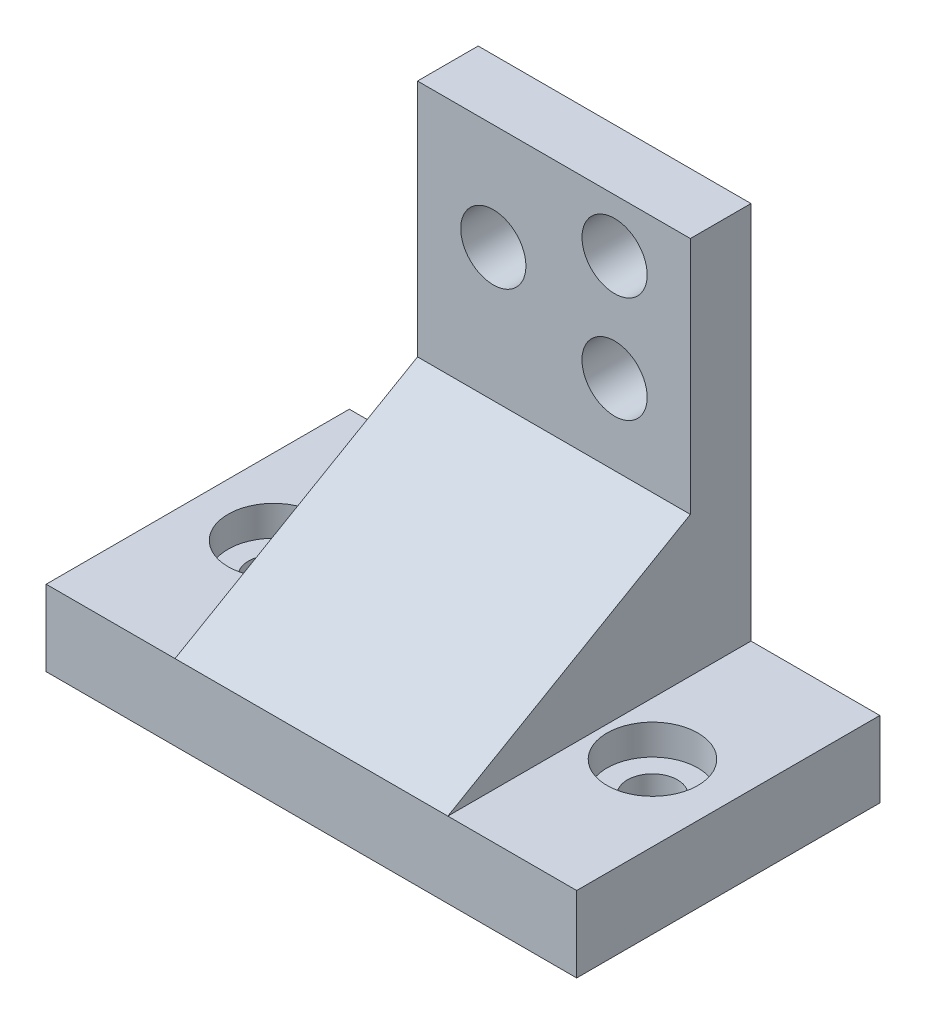
ISO-10303-21;
HEADER;
FILE_DESCRIPTION(('STEP AP214'),'2;1');
FILE_NAME('part.step','',(''),(''),'','','');
FILE_SCHEMA(('AUTOMOTIVE_DESIGN { 1 0 10303 214 1 1 1 1 }'));
ENDSEC;
DATA;
#1=APPLICATION_CONTEXT('core data for automotive mechanical design processes');
#2=APPLICATION_PROTOCOL_DEFINITION('international standard','automotive_design',2000,#1);
#3=PRODUCT_CONTEXT('',#1,'mechanical');
#4=PRODUCT('Part','Part','',(#3));
#5=PRODUCT_RELATED_PRODUCT_CATEGORY('part','',(#4));
#6=PRODUCT_DEFINITION_FORMATION('','',#4);
#7=PRODUCT_DEFINITION_CONTEXT('part definition',#1,'design');
#8=PRODUCT_DEFINITION('design','',#6,#7);
#9=PRODUCT_DEFINITION_SHAPE('','',#8);
#10=(LENGTH_UNIT() NAMED_UNIT(*) SI_UNIT(.MILLI.,.METRE.));
#11=(NAMED_UNIT(*) PLANE_ANGLE_UNIT() SI_UNIT($,.RADIAN.));
#12=(NAMED_UNIT(*) SI_UNIT($,.STERADIAN.) SOLID_ANGLE_UNIT());
#13=UNCERTAINTY_MEASURE_WITH_UNIT(LENGTH_MEASURE(1.E-05),#10,'distance_accuracy_value','');
#14=(GEOMETRIC_REPRESENTATION_CONTEXT(3) GLOBAL_UNCERTAINTY_ASSIGNED_CONTEXT((#13)) GLOBAL_UNIT_ASSIGNED_CONTEXT((#10,
#11,#12)) REPRESENTATION_CONTEXT('',''));
#15=CARTESIAN_POINT('',(0.,0.,0.));
#16=DIRECTION('',(0.,0.,1.));
#17=DIRECTION('',(1.,0.,0.));
#18=AXIS2_PLACEMENT_3D('',#15,#16,#17);
#19=CARTESIAN_POINT('',(0.,5.,0.));
#20=DIRECTION('',(0.,-1.,0.));
#21=DIRECTION('',(0.,0.,-1.));
#22=AXIS2_PLACEMENT_3D('',#19,#20,#21);
#23=PLANE('',#22);
#24=CARTESIAN_POINT('',(12.5,5.,0.));
#25=DIRECTION('',(0.,1.,0.));
#26=DIRECTION('',(0.,0.,-1.));
#27=AXIS2_PLACEMENT_3D('',#24,#25,#26);
#28=CIRCLE('',#27,3.);
#29=CARTESIAN_POINT('',(12.5,5.,-3.));
#30=VERTEX_POINT('',#29);
#31=EDGE_CURVE('E221',#30,#30,#28,.T.);
#32=ORIENTED_EDGE('',*,*,#31,.F.);
#33=EDGE_LOOP('',(#32));
#34=FACE_BOUND('',#33,.T.);
#35=DIRECTION('',(0.,0.,-1.));
#36=VECTOR('',#35,1.);
#37=CARTESIAN_POINT('',(9.,5.,-6.));
#38=LINE('',#37,#36);
#39=CARTESIAN_POINT('',(9.,5.,10.));
#40=VERTEX_POINT('',#39);
#41=CARTESIAN_POINT('',(9.,5.,-10.));
#42=VERTEX_POINT('',#41);
#43=EDGE_CURVE('E51',#40,#42,#38,.T.);
#44=ORIENTED_EDGE('',*,*,#43,.F.);
#45=DIRECTION('',(1.,0.,0.));
#46=VECTOR('',#45,1.);
#47=CARTESIAN_POINT('',(-17.5,5.,10.));
#48=LINE('',#47,#46);
#49=CARTESIAN_POINT('',(17.5,5.,10.));
#50=VERTEX_POINT('',#49);
#51=EDGE_CURVE('E148',#40,#50,#48,.T.);
#52=ORIENTED_EDGE('',*,*,#51,.T.);
#53=DIRECTION('',(0.,0.,-1.));
#54=VECTOR('',#53,1.);
#55=CARTESIAN_POINT('',(17.5,5.,10.));
#56=LINE('',#55,#54);
#57=CARTESIAN_POINT('',(17.5,5.,-10.));
#58=VERTEX_POINT('',#57);
#59=EDGE_CURVE('E139',#50,#58,#56,.T.);
#60=ORIENTED_EDGE('',*,*,#59,.T.);
#61=DIRECTION('',(-1.,0.,0.));
#62=VECTOR('',#61,1.);
#63=CARTESIAN_POINT('',(-17.5,5.,-10.));
#64=LINE('',#63,#62);
#65=EDGE_CURVE('E144',#58,#42,#64,.T.);
#66=ORIENTED_EDGE('',*,*,#65,.T.);
#67=EDGE_LOOP('',(#44,#52,#60,#66));
#68=FACE_BOUND('',#67,.T.);
#69=ADVANCED_FACE('F35',(#34,#68),#23,.F.);
#70=CARTESIAN_POINT('',(-12.5,5.,0.));
#71=DIRECTION('',(0.,-1.,0.));
#72=DIRECTION('',(0.,0.,-1.));
#73=AXIS2_PLACEMENT_3D('',#70,#71,#72);
#74=CYLINDRICAL_SURFACE('',#73,1.65);
#75=CARTESIAN_POINT('',(-12.5,0.,0.));
#76=DIRECTION('',(0.,1.,0.));
#77=DIRECTION('',(0.,0.,1.));
#78=AXIS2_PLACEMENT_3D('',#75,#76,#77);
#79=CIRCLE('',#78,1.65);
#80=CARTESIAN_POINT('',(-12.5,0.,1.65));
#81=VERTEX_POINT('',#80);
#82=EDGE_CURVE('E130',#81,#81,#79,.T.);
#83=ORIENTED_EDGE('',*,*,#82,.F.);
#84=EDGE_LOOP('',(#83));
#85=FACE_BOUND('',#84,.T.);
#86=CARTESIAN_POINT('',(-12.5,3.,0.));
#87=DIRECTION('',(0.,1.,0.));
#88=DIRECTION('',(0.,0.,1.));
#89=AXIS2_PLACEMENT_3D('',#86,#87,#88);
#90=CIRCLE('',#89,1.65);
#91=CARTESIAN_POINT('',(-12.5,3.,1.65));
#92=VERTEX_POINT('',#91);
#93=EDGE_CURVE('E176',#92,#92,#90,.T.);
#94=ORIENTED_EDGE('',*,*,#93,.T.);
#95=EDGE_LOOP('',(#94));
#96=FACE_BOUND('',#95,.T.);
#97=ADVANCED_FACE('F246',(#85,#96),#74,.F.);
#98=CARTESIAN_POINT('',(-12.5,5.,0.));
#99=DIRECTION('',(0.,1.,0.));
#100=DIRECTION('',(0.,0.,1.));
#101=AXIS2_PLACEMENT_3D('',#98,#99,#100);
#102=CIRCLE('',#101,3.);
#103=CARTESIAN_POINT('',(-12.5,5.,3.));
#104=VERTEX_POINT('',#103);
#105=EDGE_CURVE('E227',#104,#104,#102,.T.);
#106=ORIENTED_EDGE('',*,*,#105,.F.);
#107=EDGE_LOOP('',(#106));
#108=FACE_BOUND('',#107,.T.);
#109=CARTESIAN_POINT('',(-17.5,5.,10.));
#110=VERTEX_POINT('',#109);
#111=CARTESIAN_POINT('',(-9.,5.,10.));
#112=VERTEX_POINT('',#111);
#113=EDGE_CURVE('E149',#110,#112,#48,.T.);
#114=ORIENTED_EDGE('',*,*,#113,.T.);
#115=DIRECTION('',(0.,0.,1.));
#116=VECTOR('',#115,1.);
#117=CARTESIAN_POINT('',(-9.,5.,-6.));
#118=LINE('',#117,#116);
#119=CARTESIAN_POINT('',(-9.,5.,-10.));
#120=VERTEX_POINT('',#119);
#121=EDGE_CURVE('E58',#120,#112,#118,.T.);
#122=ORIENTED_EDGE('',*,*,#121,.F.);
#123=CARTESIAN_POINT('',(-17.5,5.,-10.));
#124=VERTEX_POINT('',#123);
#125=EDGE_CURVE('E142',#120,#124,#64,.T.);
#126=ORIENTED_EDGE('',*,*,#125,.T.);
#127=DIRECTION('',(0.,0.,1.));
#128=VECTOR('',#127,1.);
#129=CARTESIAN_POINT('',(-17.5,5.,10.));
#130=LINE('',#129,#128);
#131=EDGE_CURVE('E146',#124,#110,#130,.T.);
#132=ORIENTED_EDGE('',*,*,#131,.T.);
#133=EDGE_LOOP('',(#114,#122,#126,#132));
#134=FACE_BOUND('',#133,.T.);
#135=ADVANCED_FACE('F242',(#108,#134),#23,.F.);
#136=CARTESIAN_POINT('',(0.,0.,0.));
#137=DIRECTION('',(0.,-1.,0.));
#138=DIRECTION('',(0.,0.,-1.));
#139=AXIS2_PLACEMENT_3D('',#136,#137,#138);
#140=PLANE('',#139);
#141=ORIENTED_EDGE('',*,*,#82,.T.);
#142=EDGE_LOOP('',(#141));
#143=FACE_BOUND('',#142,.T.);
#144=DIRECTION('',(0.,0.,-1.));
#145=VECTOR('',#144,1.);
#146=CARTESIAN_POINT('',(17.5,0.,10.));
#147=LINE('',#146,#145);
#148=CARTESIAN_POINT('',(17.5,0.,10.));
#149=VERTEX_POINT('',#148);
#150=CARTESIAN_POINT('',(17.5,0.,-10.));
#151=VERTEX_POINT('',#150);
#152=EDGE_CURVE('E138',#149,#151,#147,.T.);
#153=ORIENTED_EDGE('',*,*,#152,.F.);
#154=DIRECTION('',(1.,0.,0.));
#155=VECTOR('',#154,1.);
#156=CARTESIAN_POINT('',(-17.5,0.,10.));
#157=LINE('',#156,#155);
#158=CARTESIAN_POINT('',(-17.5,0.,10.));
#159=VERTEX_POINT('',#158);
#160=EDGE_CURVE('E143',#159,#149,#157,.T.);
#161=ORIENTED_EDGE('',*,*,#160,.F.);
#162=DIRECTION('',(0.,0.,1.));
#163=VECTOR('',#162,1.);
#164=CARTESIAN_POINT('',(-17.5,0.,10.));
#165=LINE('',#164,#163);
#166=CARTESIAN_POINT('',(-17.5,0.,-10.));
#167=VERTEX_POINT('',#166);
#168=EDGE_CURVE('E158',#167,#159,#165,.T.);
#169=ORIENTED_EDGE('',*,*,#168,.F.);
#170=DIRECTION('',(-1.,0.,0.));
#171=VECTOR('',#170,1.);
#172=CARTESIAN_POINT('',(-17.5,0.,-10.));
#173=LINE('',#172,#171);
#174=EDGE_CURVE('E156',#151,#167,#173,.T.);
#175=ORIENTED_EDGE('',*,*,#174,.F.);
#176=EDGE_LOOP('',(#153,#161,#169,#175));
#177=FACE_BOUND('',#176,.T.);
#178=CARTESIAN_POINT('',(12.5,0.,0.));
#179=DIRECTION('',(0.,1.,0.));
#180=DIRECTION('',(0.,0.,-1.));
#181=AXIS2_PLACEMENT_3D('',#178,#179,#180);
#182=CIRCLE('',#181,1.65);
#183=CARTESIAN_POINT('',(12.5,0.,-1.65));
#184=VERTEX_POINT('',#183);
#185=EDGE_CURVE('E127',#184,#184,#182,.T.);
#186=ORIENTED_EDGE('',*,*,#185,.T.);
#187=EDGE_LOOP('',(#186));
#188=FACE_BOUND('',#187,.T.);
#189=ADVANCED_FACE('F245',(#143,#177,#188),#140,.T.);
#190=CARTESIAN_POINT('',(17.5,5.,10.));
#191=DIRECTION('',(-1.,0.,0.));
#192=DIRECTION('',(0.,0.,1.));
#193=AXIS2_PLACEMENT_3D('',#190,#191,#192);
#194=PLANE('',#193);
#195=ORIENTED_EDGE('',*,*,#152,.T.);
#196=DIRECTION('',(0.,-1.,0.));
#197=VECTOR('',#196,1.);
#198=CARTESIAN_POINT('',(17.5,5.,-10.));
#199=LINE('',#198,#197);
#200=EDGE_CURVE('E169',#58,#151,#199,.T.);
#201=ORIENTED_EDGE('',*,*,#200,.F.);
#202=ORIENTED_EDGE('',*,*,#59,.F.);
#203=DIRECTION('',(0.,-1.,0.));
#204=VECTOR('',#203,1.);
#205=CARTESIAN_POINT('',(17.5,5.,10.));
#206=LINE('',#205,#204);
#207=EDGE_CURVE('E152',#50,#149,#206,.T.);
#208=ORIENTED_EDGE('',*,*,#207,.T.);
#209=EDGE_LOOP('',(#195,#201,#202,#208));
#210=FACE_BOUND('',#209,.T.);
#211=ADVANCED_FACE('F258',(#210),#194,.F.);
#212=CARTESIAN_POINT('',(-17.5,5.,-10.));
#213=DIRECTION('',(0.,0.,1.));
#214=DIRECTION('',(1.,0.,0.));
#215=AXIS2_PLACEMENT_3D('',#212,#213,#214);
#216=PLANE('',#215);
#217=CARTESIAN_POINT('',(-4.,23.,-10.));
#218=DIRECTION('',(0.,0.,1.));
#219=DIRECTION('',(1.,0.,0.));
#220=AXIS2_PLACEMENT_3D('',#217,#218,#219);
#221=CIRCLE('',#220,2.15);
#222=CARTESIAN_POINT('',(-1.85,23.,-10.));
#223=VERTEX_POINT('',#222);
#224=EDGE_CURVE('E202',#223,#223,#221,.F.);
#225=ORIENTED_EDGE('',*,*,#224,.F.);
#226=EDGE_LOOP('',(#225));
#227=FACE_BOUND('',#226,.T.);
#228=CARTESIAN_POINT('',(4.,26.5,-10.));
#229=DIRECTION('',(0.,0.,1.));
#230=DIRECTION('',(1.,0.,0.));
#231=AXIS2_PLACEMENT_3D('',#228,#229,#230);
#232=CIRCLE('',#231,2.15);
#233=CARTESIAN_POINT('',(6.15,26.5,-10.));
#234=VERTEX_POINT('',#233);
#235=EDGE_CURVE('E211',#234,#234,#232,.F.);
#236=ORIENTED_EDGE('',*,*,#235,.F.);
#237=EDGE_LOOP('',(#236));
#238=FACE_BOUND('',#237,.T.);
#239=CARTESIAN_POINT('',(4.,19.5,-10.));
#240=DIRECTION('',(0.,0.,1.));
#241=DIRECTION('',(1.,0.,0.));
#242=AXIS2_PLACEMENT_3D('',#239,#240,#241);
#243=CIRCLE('',#242,2.15);
#244=CARTESIAN_POINT('',(6.15,19.5,-10.));
#245=VERTEX_POINT('',#244);
#246=EDGE_CURVE('E205',#245,#245,#243,.F.);
#247=ORIENTED_EDGE('',*,*,#246,.F.);
#248=EDGE_LOOP('',(#247));
#249=FACE_BOUND('',#248,.T.);
#250=ORIENTED_EDGE('',*,*,#174,.T.);
#251=DIRECTION('',(0.,-1.,0.));
#252=VECTOR('',#251,1.);
#253=CARTESIAN_POINT('',(-17.5,5.,-10.));
#254=LINE('',#253,#252);
#255=EDGE_CURVE('E166',#124,#167,#254,.T.);
#256=ORIENTED_EDGE('',*,*,#255,.F.);
#257=ORIENTED_EDGE('',*,*,#125,.F.);
#258=DIRECTION('',(0.,-1.,0.));
#259=VECTOR('',#258,1.);
#260=CARTESIAN_POINT('',(-9.,30.,-10.));
#261=LINE('',#260,#259);
#262=CARTESIAN_POINT('',(-9.,30.,-10.));
#263=VERTEX_POINT('',#262);
#264=EDGE_CURVE('E112',#263,#120,#261,.T.);
#265=ORIENTED_EDGE('',*,*,#264,.F.);
#266=DIRECTION('',(-1.,0.,0.));
#267=VECTOR('',#266,1.);
#268=CARTESIAN_POINT('',(-9.,30.,-10.));
#269=LINE('',#268,#267);
#270=CARTESIAN_POINT('',(9.,30.,-10.));
#271=VERTEX_POINT('',#270);
#272=EDGE_CURVE('E106',#271,#263,#269,.T.);
#273=ORIENTED_EDGE('',*,*,#272,.F.);
#274=DIRECTION('',(0.,-1.,0.));
#275=VECTOR('',#274,1.);
#276=CARTESIAN_POINT('',(9.,30.,-10.));
#277=LINE('',#276,#275);
#278=EDGE_CURVE('E110',#271,#42,#277,.T.);
#279=ORIENTED_EDGE('',*,*,#278,.T.);
#280=ORIENTED_EDGE('',*,*,#65,.F.);
#281=ORIENTED_EDGE('',*,*,#200,.T.);
#282=EDGE_LOOP('',(#250,#256,#257,#265,#273,#279,#280,#281));
#283=FACE_BOUND('',#282,.T.);
#284=ADVANCED_FACE('F108',(#227,#238,#249,#283),#216,.F.);
#285=CARTESIAN_POINT('',(-17.5,5.,10.));
#286=DIRECTION('',(1.,0.,0.));
#287=DIRECTION('',(0.,0.,-1.));
#288=AXIS2_PLACEMENT_3D('',#285,#286,#287);
#289=PLANE('',#288);
#290=ORIENTED_EDGE('',*,*,#168,.T.);
#291=DIRECTION('',(0.,-1.,0.));
#292=VECTOR('',#291,1.);
#293=CARTESIAN_POINT('',(-17.5,5.,10.));
#294=LINE('',#293,#292);
#295=EDGE_CURVE('E163',#110,#159,#294,.T.);
#296=ORIENTED_EDGE('',*,*,#295,.F.);
#297=ORIENTED_EDGE('',*,*,#131,.F.);
#298=ORIENTED_EDGE('',*,*,#255,.T.);
#299=EDGE_LOOP('',(#290,#296,#297,#298));
#300=FACE_BOUND('',#299,.T.);
#301=ADVANCED_FACE('F260',(#300),#289,.F.);
#302=CARTESIAN_POINT('',(-17.5,5.,10.));
#303=DIRECTION('',(0.,0.,-1.));
#304=DIRECTION('',(-1.,0.,0.));
#305=AXIS2_PLACEMENT_3D('',#302,#303,#304);
#306=PLANE('',#305);
#307=ORIENTED_EDGE('',*,*,#160,.T.);
#308=ORIENTED_EDGE('',*,*,#207,.F.);
#309=ORIENTED_EDGE('',*,*,#51,.F.);
#310=EDGE_CURVE('E153',#112,#40,#48,.T.);
#311=ORIENTED_EDGE('',*,*,#310,.F.);
#312=ORIENTED_EDGE('',*,*,#113,.F.);
#313=ORIENTED_EDGE('',*,*,#295,.T.);
#314=EDGE_LOOP('',(#307,#308,#309,#311,#312,#313));
#315=FACE_BOUND('',#314,.T.);
#316=ADVANCED_FACE('F189',(#315),#306,.F.);
#317=CARTESIAN_POINT('',(12.5,5.,0.));
#318=DIRECTION('',(0.,-1.,0.));
#319=DIRECTION('',(0.,0.,-1.));
#320=AXIS2_PLACEMENT_3D('',#317,#318,#319);
#321=CYLINDRICAL_SURFACE('',#320,1.65);
#322=CARTESIAN_POINT('',(12.5,3.,0.));
#323=DIRECTION('',(0.,-1.,0.));
#324=DIRECTION('',(0.,0.,-1.));
#325=AXIS2_PLACEMENT_3D('',#322,#323,#324);
#326=CIRCLE('',#325,1.65);
#327=CARTESIAN_POINT('',(12.5,3.,-1.65));
#328=VERTEX_POINT('',#327);
#329=EDGE_CURVE('E173',#328,#328,#326,.T.);
#330=ORIENTED_EDGE('',*,*,#329,.F.);
#331=EDGE_LOOP('',(#330));
#332=FACE_BOUND('',#331,.T.);
#333=ORIENTED_EDGE('',*,*,#185,.F.);
#334=EDGE_LOOP('',(#333));
#335=FACE_BOUND('',#334,.T.);
#336=ADVANCED_FACE('F267',(#332,#335),#321,.F.);
#337=CARTESIAN_POINT('',(9.,30.,-6.));
#338=DIRECTION('',(-1.,0.,0.));
#339=DIRECTION('',(0.,0.,1.));
#340=AXIS2_PLACEMENT_3D('',#337,#338,#339);
#341=PLANE('',#340);
#342=ORIENTED_EDGE('',*,*,#43,.T.);
#343=ORIENTED_EDGE('',*,*,#278,.F.);
#344=DIRECTION('',(0.,0.,-1.));
#345=VECTOR('',#344,1.);
#346=CARTESIAN_POINT('',(9.,30.,-6.));
#347=LINE('',#346,#345);
#348=CARTESIAN_POINT('',(9.,30.,-6.));
#349=VERTEX_POINT('',#348);
#350=EDGE_CURVE('E116',#349,#271,#347,.T.);
#351=ORIENTED_EDGE('',*,*,#350,.F.);
#352=DIRECTION('',(0.,-1.,0.));
#353=VECTOR('',#352,1.);
#354=CARTESIAN_POINT('',(9.,30.,-6.));
#355=LINE('',#354,#353);
#356=CARTESIAN_POINT('',(9.,14.2376043070341,-6.));
#357=VERTEX_POINT('',#356);
#358=EDGE_CURVE('E183',#349,#357,#355,.T.);
#359=ORIENTED_EDGE('',*,*,#358,.T.);
#360=DIRECTION('',(0.,0.500000000000004,-0.866025403784436));
#361=VECTOR('',#360,1.);
#362=CARTESIAN_POINT('',(9.,18.1782032302756,-12.8253175473055));
#363=LINE('',#362,#361);
#364=EDGE_CURVE('E44',#357,#40,#363,.F.);
#365=ORIENTED_EDGE('',*,*,#364,.T.);
#366=EDGE_LOOP('',(#342,#343,#351,#359,#365));
#367=FACE_BOUND('',#366,.T.);
#368=ADVANCED_FACE('F126',(#367),#341,.F.);
#369=CARTESIAN_POINT('',(-9.,30.,-6.));
#370=DIRECTION('',(1.,0.,0.));
#371=DIRECTION('',(0.,0.,-1.));
#372=AXIS2_PLACEMENT_3D('',#369,#370,#371);
#373=PLANE('',#372);
#374=ORIENTED_EDGE('',*,*,#121,.T.);
#375=DIRECTION('',(0.,-0.500000000000004,0.866025403784436));
#376=VECTOR('',#375,1.);
#377=CARTESIAN_POINT('',(-9.,18.1782032302756,-12.8253175473055));
#378=LINE('',#377,#376);
#379=CARTESIAN_POINT('',(-9.,14.2376043070341,-6.));
#380=VERTEX_POINT('',#379);
#381=EDGE_CURVE('E11',#112,#380,#378,.F.);
#382=ORIENTED_EDGE('',*,*,#381,.T.);
#383=DIRECTION('',(0.,-1.,0.));
#384=VECTOR('',#383,1.);
#385=CARTESIAN_POINT('',(-9.,30.,-6.));
#386=LINE('',#385,#384);
#387=CARTESIAN_POINT('',(-9.,30.,-6.));
#388=VERTEX_POINT('',#387);
#389=EDGE_CURVE('E132',#388,#380,#386,.T.);
#390=ORIENTED_EDGE('',*,*,#389,.F.);
#391=DIRECTION('',(0.,0.,1.));
#392=VECTOR('',#391,1.);
#393=CARTESIAN_POINT('',(-9.,30.,-6.));
#394=LINE('',#393,#392);
#395=EDGE_CURVE('E115',#263,#388,#394,.T.);
#396=ORIENTED_EDGE('',*,*,#395,.F.);
#397=ORIENTED_EDGE('',*,*,#264,.T.);
#398=EDGE_LOOP('',(#374,#382,#390,#396,#397));
#399=FACE_BOUND('',#398,.T.);
#400=ADVANCED_FACE('F195',(#399),#373,.F.);
#401=CARTESIAN_POINT('',(-9.,30.,-6.));
#402=DIRECTION('',(0.,0.,-1.));
#403=DIRECTION('',(-1.,0.,0.));
#404=AXIS2_PLACEMENT_3D('',#401,#402,#403);
#405=PLANE('',#404);
#406=CARTESIAN_POINT('',(-4.,23.,-6.));
#407=DIRECTION('',(0.,0.,1.));
#408=DIRECTION('',(1.,0.,0.));
#409=AXIS2_PLACEMENT_3D('',#406,#407,#408);
#410=CIRCLE('',#409,2.15);
#411=CARTESIAN_POINT('',(-1.85,23.,-6.));
#412=VERTEX_POINT('',#411);
#413=EDGE_CURVE('E214',#412,#412,#410,.T.);
#414=ORIENTED_EDGE('',*,*,#413,.F.);
#415=EDGE_LOOP('',(#414));
#416=FACE_BOUND('',#415,.T.);
#417=CARTESIAN_POINT('',(4.,26.5,-6.));
#418=DIRECTION('',(0.,0.,1.));
#419=DIRECTION('',(1.,0.,0.));
#420=AXIS2_PLACEMENT_3D('',#417,#418,#419);
#421=CIRCLE('',#420,2.15);
#422=CARTESIAN_POINT('',(6.15,26.5,-6.));
#423=VERTEX_POINT('',#422);
#424=EDGE_CURVE('E208',#423,#423,#421,.T.);
#425=ORIENTED_EDGE('',*,*,#424,.F.);
#426=EDGE_LOOP('',(#425));
#427=FACE_BOUND('',#426,.T.);
#428=CARTESIAN_POINT('',(4.,19.5,-6.));
#429=DIRECTION('',(0.,0.,1.));
#430=DIRECTION('',(-1.,0.,0.));
#431=AXIS2_PLACEMENT_3D('',#428,#429,#430);
#432=CIRCLE('',#431,2.15);
#433=CARTESIAN_POINT('',(1.85,19.5,-6.));
#434=VERTEX_POINT('',#433);
#435=EDGE_CURVE('E180',#434,#434,#432,.T.);
#436=ORIENTED_EDGE('',*,*,#435,.F.);
#437=EDGE_LOOP('',(#436));
#438=FACE_BOUND('',#437,.T.);
#439=ORIENTED_EDGE('',*,*,#389,.T.);
#440=DIRECTION('',(1.,0.,0.));
#441=VECTOR('',#440,1.);
#442=CARTESIAN_POINT('',(9.,14.2376043070341,-6.));
#443=LINE('',#442,#441);
#444=EDGE_CURVE('E172',#380,#357,#443,.T.);
#445=ORIENTED_EDGE('',*,*,#444,.T.);
#446=ORIENTED_EDGE('',*,*,#358,.F.);
#447=DIRECTION('',(1.,0.,0.));
#448=VECTOR('',#447,1.);
#449=CARTESIAN_POINT('',(-9.,30.,-6.));
#450=LINE('',#449,#448);
#451=EDGE_CURVE('E121',#388,#349,#450,.T.);
#452=ORIENTED_EDGE('',*,*,#451,.F.);
#453=EDGE_LOOP('',(#439,#445,#446,#452));
#454=FACE_BOUND('',#453,.T.);
#455=ADVANCED_FACE('F197',(#416,#427,#438,#454),#405,.F.);
#456=CARTESIAN_POINT('',(0.,30.,0.));
#457=DIRECTION('',(0.,-1.,0.));
#458=DIRECTION('',(0.,0.,-1.));
#459=AXIS2_PLACEMENT_3D('',#456,#457,#458);
#460=PLANE('',#459);
#461=ORIENTED_EDGE('',*,*,#350,.T.);
#462=ORIENTED_EDGE('',*,*,#272,.T.);
#463=ORIENTED_EDGE('',*,*,#395,.T.);
#464=ORIENTED_EDGE('',*,*,#451,.T.);
#465=EDGE_LOOP('',(#461,#462,#463,#464));
#466=FACE_BOUND('',#465,.T.);
#467=ADVANCED_FACE('F119',(#466),#460,.F.);
#468=CARTESIAN_POINT('',(4.,19.5,-10.001));
#469=DIRECTION('',(0.,0.,1.));
#470=DIRECTION('',(1.,0.,0.));
#471=AXIS2_PLACEMENT_3D('',#468,#469,#470);
#472=CYLINDRICAL_SURFACE('',#471,2.15);
#473=ORIENTED_EDGE('',*,*,#435,.T.);
#474=EDGE_LOOP('',(#473));
#475=FACE_BOUND('',#474,.T.);
#476=ORIENTED_EDGE('',*,*,#246,.T.);
#477=EDGE_LOOP('',(#476));
#478=FACE_BOUND('',#477,.T.);
#479=ADVANCED_FACE('F310',(#475,#478),#472,.F.);
#480=CARTESIAN_POINT('',(4.,26.5,-10.001));
#481=DIRECTION('',(0.,0.,1.));
#482=DIRECTION('',(1.,0.,0.));
#483=AXIS2_PLACEMENT_3D('',#480,#481,#482);
#484=CYLINDRICAL_SURFACE('',#483,2.15);
#485=ORIENTED_EDGE('',*,*,#424,.T.);
#486=EDGE_LOOP('',(#485));
#487=FACE_BOUND('',#486,.T.);
#488=ORIENTED_EDGE('',*,*,#235,.T.);
#489=EDGE_LOOP('',(#488));
#490=FACE_BOUND('',#489,.T.);
#491=ADVANCED_FACE('F306',(#487,#490),#484,.F.);
#492=CARTESIAN_POINT('',(-4.,23.,-10.001));
#493=DIRECTION('',(0.,0.,1.));
#494=DIRECTION('',(1.,0.,0.));
#495=AXIS2_PLACEMENT_3D('',#492,#493,#494);
#496=CYLINDRICAL_SURFACE('',#495,2.15);
#497=ORIENTED_EDGE('',*,*,#413,.T.);
#498=EDGE_LOOP('',(#497));
#499=FACE_BOUND('',#498,.T.);
#500=ORIENTED_EDGE('',*,*,#224,.T.);
#501=EDGE_LOOP('',(#500));
#502=FACE_BOUND('',#501,.T.);
#503=ADVANCED_FACE('F302',(#499,#502),#496,.F.);
#504=CARTESIAN_POINT('',(12.5,3.,0.));
#505=DIRECTION('',(0.,1.,0.));
#506=DIRECTION('',(0.,0.,1.));
#507=AXIS2_PLACEMENT_3D('',#504,#505,#506);
#508=CYLINDRICAL_SURFACE('',#507,3.);
#509=CARTESIAN_POINT('',(12.5,3.,0.));
#510=DIRECTION('',(0.,1.,0.));
#511=DIRECTION('',(0.,0.,-1.));
#512=AXIS2_PLACEMENT_3D('',#509,#510,#511);
#513=CIRCLE('',#512,3.);
#514=CARTESIAN_POINT('',(12.5,3.,-3.));
#515=VERTEX_POINT('',#514);
#516=EDGE_CURVE('E224',#515,#515,#513,.T.);
#517=ORIENTED_EDGE('',*,*,#516,.F.);
#518=EDGE_LOOP('',(#517));
#519=FACE_BOUND('',#518,.T.);
#520=ORIENTED_EDGE('',*,*,#31,.T.);
#521=EDGE_LOOP('',(#520));
#522=FACE_BOUND('',#521,.T.);
#523=ADVANCED_FACE('F298',(#519,#522),#508,.F.);
#524=CARTESIAN_POINT('',(12.5,3.,0.));
#525=DIRECTION('',(0.,-1.,0.));
#526=DIRECTION('',(0.,0.,-1.));
#527=AXIS2_PLACEMENT_3D('',#524,#525,#526);
#528=PLANE('',#527);
#529=ORIENTED_EDGE('',*,*,#329,.T.);
#530=EDGE_LOOP('',(#529));
#531=FACE_BOUND('',#530,.T.);
#532=ORIENTED_EDGE('',*,*,#516,.T.);
#533=EDGE_LOOP('',(#532));
#534=FACE_BOUND('',#533,.T.);
#535=ADVANCED_FACE('F238',(#531,#534),#528,.F.);
#536=CARTESIAN_POINT('',(-12.5,3.,0.));
#537=DIRECTION('',(0.,1.,0.));
#538=DIRECTION('',(0.,0.,1.));
#539=AXIS2_PLACEMENT_3D('',#536,#537,#538);
#540=CYLINDRICAL_SURFACE('',#539,3.);
#541=CARTESIAN_POINT('',(-12.5,3.,0.));
#542=DIRECTION('',(0.,1.,0.));
#543=DIRECTION('',(0.,0.,1.));
#544=AXIS2_PLACEMENT_3D('',#541,#542,#543);
#545=CIRCLE('',#544,3.);
#546=CARTESIAN_POINT('',(-12.5,3.,3.));
#547=VERTEX_POINT('',#546);
#548=EDGE_CURVE('E177',#547,#547,#545,.T.);
#549=ORIENTED_EDGE('',*,*,#548,.F.);
#550=EDGE_LOOP('',(#549));
#551=FACE_BOUND('',#550,.T.);
#552=ORIENTED_EDGE('',*,*,#105,.T.);
#553=EDGE_LOOP('',(#552));
#554=FACE_BOUND('',#553,.T.);
#555=ADVANCED_FACE('F235',(#551,#554),#540,.F.);
#556=CARTESIAN_POINT('',(-12.5,3.,0.));
#557=DIRECTION('',(0.,1.,0.));
#558=DIRECTION('',(0.,0.,1.));
#559=AXIS2_PLACEMENT_3D('',#556,#557,#558);
#560=PLANE('',#559);
#561=ORIENTED_EDGE('',*,*,#93,.F.);
#562=EDGE_LOOP('',(#561));
#563=FACE_BOUND('',#562,.T.);
#564=ORIENTED_EDGE('',*,*,#548,.T.);
#565=EDGE_LOOP('',(#564));
#566=FACE_BOUND('',#565,.T.);
#567=ADVANCED_FACE('F233',(#563,#566),#560,.T.);
#568=CARTESIAN_POINT('',(-9.,14.2376043070341,-6.));
#569=DIRECTION('',(0.,0.866025403784436,0.500000000000004));
#570=DIRECTION('',(-1.,0.,0.));
#571=AXIS2_PLACEMENT_3D('',#568,#569,#570);
#572=PLANE('',#571);
#573=ORIENTED_EDGE('',*,*,#381,.F.);
#574=ORIENTED_EDGE('',*,*,#310,.T.);
#575=ORIENTED_EDGE('',*,*,#364,.F.);
#576=ORIENTED_EDGE('',*,*,#444,.F.);
#577=EDGE_LOOP('',(#573,#574,#575,#576));
#578=FACE_BOUND('',#577,.T.);
#579=ADVANCED_FACE('F38',(#578),#572,.T.);
#580=CLOSED_SHELL('',(#69,#97,#135,#189,#211,#284,#301,#316,#336,#368,#400,#455,#467,#479,#491,
#503,#523,#535,#555,#567,#579));
#581=MANIFOLD_SOLID_BREP('B2',#580);
#582=ADVANCED_BREP_SHAPE_REPRESENTATION('',(#18,#581),#14);
#583=SHAPE_DEFINITION_REPRESENTATION(#9,#582);
ENDSEC;
END-ISO-10303-21;
